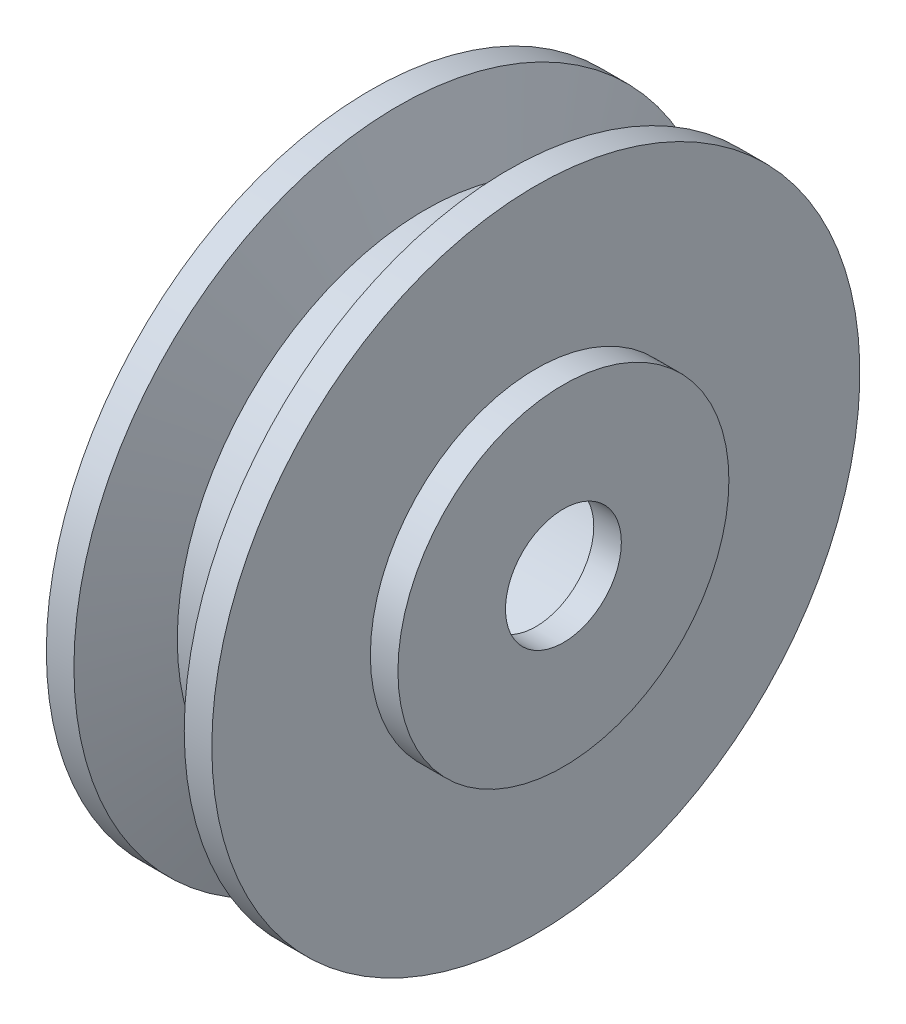
ISO-10303-21;
HEADER;
FILE_DESCRIPTION(('STEP AP214'),'2;1');
FILE_NAME('part.step','',(''),(''),'','','');
FILE_SCHEMA(('AUTOMOTIVE_DESIGN { 1 0 10303 214 1 1 1 1 }'));
ENDSEC;
DATA;
#1=APPLICATION_CONTEXT('core data for automotive mechanical design processes');
#2=APPLICATION_PROTOCOL_DEFINITION('international standard','automotive_design',2000,#1);
#3=PRODUCT_CONTEXT('',#1,'mechanical');
#4=PRODUCT('Part','Part','',(#3));
#5=PRODUCT_RELATED_PRODUCT_CATEGORY('part','',(#4));
#6=PRODUCT_DEFINITION_FORMATION('','',#4);
#7=PRODUCT_DEFINITION_CONTEXT('part definition',#1,'design');
#8=PRODUCT_DEFINITION('design','',#6,#7);
#9=PRODUCT_DEFINITION_SHAPE('','',#8);
#10=(LENGTH_UNIT() NAMED_UNIT(*) SI_UNIT(.MILLI.,.METRE.));
#11=(NAMED_UNIT(*) PLANE_ANGLE_UNIT() SI_UNIT($,.RADIAN.));
#12=(NAMED_UNIT(*) SI_UNIT($,.STERADIAN.) SOLID_ANGLE_UNIT());
#13=UNCERTAINTY_MEASURE_WITH_UNIT(LENGTH_MEASURE(1.E-05),#10,'distance_accuracy_value','');
#14=(GEOMETRIC_REPRESENTATION_CONTEXT(3) GLOBAL_UNCERTAINTY_ASSIGNED_CONTEXT((#13)) GLOBAL_UNIT_ASSIGNED_CONTEXT((#10,
#11,#12)) REPRESENTATION_CONTEXT('',''));
#15=CARTESIAN_POINT('',(0.,0.,0.));
#16=DIRECTION('',(0.,0.,1.));
#17=DIRECTION('',(1.,0.,0.));
#18=AXIS2_PLACEMENT_3D('',#15,#16,#17);
#19=CARTESIAN_POINT('',(-4.,0.,0.));
#20=DIRECTION('',(-1.,0.,0.));
#21=DIRECTION('',(0.,0.,1.));
#22=AXIS2_PLACEMENT_3D('',#19,#20,#21);
#23=PLANE('',#22);
#24=CARTESIAN_POINT('',(-4.,0.,0.));
#25=DIRECTION('',(-1.,0.,0.));
#26=DIRECTION('',(0.,0.,1.));
#27=AXIS2_PLACEMENT_3D('',#24,#25,#26);
#28=CIRCLE('',#27,6.);
#29=CARTESIAN_POINT('',(-4.,0.,6.));
#30=VERTEX_POINT('',#29);
#31=EDGE_CURVE('E11',#30,#30,#28,.T.);
#32=ORIENTED_EDGE('',*,*,#31,.T.);
#33=EDGE_LOOP('',(#32));
#34=FACE_BOUND('',#33,.T.);
#35=CARTESIAN_POINT('',(-4.,0.,0.));
#36=DIRECTION('',(-1.,0.,0.));
#37=DIRECTION('',(0.,0.,1.));
#38=AXIS2_PLACEMENT_3D('',#35,#36,#37);
#39=CIRCLE('',#38,2.1);
#40=CARTESIAN_POINT('',(-4.,0.,2.1));
#41=VERTEX_POINT('',#40);
#42=EDGE_CURVE('E50',#41,#41,#39,.T.);
#43=ORIENTED_EDGE('',*,*,#42,.F.);
#44=EDGE_LOOP('',(#43));
#45=FACE_BOUND('',#44,.T.);
#46=ADVANCED_FACE('F39',(#34,#45),#23,.T.);
#47=CARTESIAN_POINT('',(-3.,0.,0.));
#48=DIRECTION('',(-1.,0.,0.));
#49=DIRECTION('',(0.,0.,1.));
#50=AXIS2_PLACEMENT_3D('',#47,#48,#49);
#51=PLANE('',#50);
#52=CARTESIAN_POINT('',(-3.,0.,0.));
#53=DIRECTION('',(-1.,0.,0.));
#54=DIRECTION('',(0.,0.,1.));
#55=AXIS2_PLACEMENT_3D('',#52,#53,#54);
#56=CIRCLE('',#55,6.);
#57=CARTESIAN_POINT('',(-3.,0.,6.));
#58=VERTEX_POINT('',#57);
#59=EDGE_CURVE('E43',#58,#58,#56,.T.);
#60=ORIENTED_EDGE('',*,*,#59,.F.);
#61=EDGE_LOOP('',(#60));
#62=FACE_BOUND('',#61,.T.);
#63=CARTESIAN_POINT('',(-3.,0.,0.));
#64=DIRECTION('',(-1.,0.,0.));
#65=DIRECTION('',(0.,0.,1.));
#66=AXIS2_PLACEMENT_3D('',#63,#64,#65);
#67=CIRCLE('',#66,2.1);
#68=CARTESIAN_POINT('',(-3.,0.,2.1));
#69=VERTEX_POINT('',#68);
#70=EDGE_CURVE('E52',#69,#69,#67,.T.);
#71=ORIENTED_EDGE('',*,*,#70,.T.);
#72=EDGE_LOOP('',(#71));
#73=FACE_BOUND('',#72,.T.);
#74=ADVANCED_FACE('F62',(#62,#73),#51,.F.);
#75=CARTESIAN_POINT('',(-4.,0.,0.));
#76=DIRECTION('',(1.,0.,0.));
#77=DIRECTION('',(0.,0.,-1.));
#78=AXIS2_PLACEMENT_3D('',#75,#76,#77);
#79=CYLINDRICAL_SURFACE('',#78,6.);
#80=ORIENTED_EDGE('',*,*,#31,.F.);
#81=EDGE_LOOP('',(#80));
#82=FACE_BOUND('',#81,.T.);
#83=ORIENTED_EDGE('',*,*,#59,.T.);
#84=EDGE_LOOP('',(#83));
#85=FACE_BOUND('',#84,.T.);
#86=ADVANCED_FACE('F41',(#82,#85),#79,.T.);
#87=CARTESIAN_POINT('',(-4.,0.,0.));
#88=DIRECTION('',(1.,0.,0.));
#89=DIRECTION('',(0.,0.,-1.));
#90=AXIS2_PLACEMENT_3D('',#87,#88,#89);
#91=CYLINDRICAL_SURFACE('',#90,2.1);
#92=ORIENTED_EDGE('',*,*,#42,.T.);
#93=EDGE_LOOP('',(#92));
#94=FACE_BOUND('',#93,.T.);
#95=ORIENTED_EDGE('',*,*,#70,.F.);
#96=EDGE_LOOP('',(#95));
#97=FACE_BOUND('',#96,.T.);
#98=ADVANCED_FACE('F58',(#94,#97),#91,.F.);
#99=CLOSED_SHELL('',(#46,#74,#86,#98));
#100=MANIFOLD_SOLID_BREP('B2',#99);
#101=CARTESIAN_POINT('',(0.,0.,0.));
#102=DIRECTION('',(-1.,0.,0.));
#103=DIRECTION('',(0.,0.,1.));
#104=AXIS2_PLACEMENT_3D('',#101,#102,#103);
#105=CYLINDRICAL_SURFACE('',#104,9.);
#106=CARTESIAN_POINT('',(1.,0.,0.));
#107=DIRECTION('',(-1.,0.,0.));
#108=DIRECTION('',(0.,0.,1.));
#109=AXIS2_PLACEMENT_3D('',#106,#107,#108);
#110=CIRCLE('',#109,9.);
#111=CARTESIAN_POINT('',(1.,0.,9.));
#112=VERTEX_POINT('',#111);
#113=EDGE_CURVE('E107',#112,#112,#110,.T.);
#114=ORIENTED_EDGE('',*,*,#113,.T.);
#115=EDGE_LOOP('',(#114));
#116=FACE_BOUND('',#115,.T.);
#117=CARTESIAN_POINT('',(-1.,0.,0.));
#118=DIRECTION('',(-1.,0.,0.));
#119=DIRECTION('',(0.,0.,1.));
#120=AXIS2_PLACEMENT_3D('',#117,#118,#119);
#121=CIRCLE('',#120,9.);
#122=CARTESIAN_POINT('',(-1.,0.,9.));
#123=VERTEX_POINT('',#122);
#124=EDGE_CURVE('E140',#123,#123,#121,.T.);
#125=ORIENTED_EDGE('',*,*,#124,.F.);
#126=EDGE_LOOP('',(#125));
#127=FACE_BOUND('',#126,.T.);
#128=ADVANCED_FACE('F101',(#116,#127),#105,.T.);
#129=CARTESIAN_POINT('',(2.,0.,0.));
#130=DIRECTION('',(1.,0.,0.));
#131=DIRECTION('',(0.,0.,-1.));
#132=AXIS2_PLACEMENT_3D('',#129,#130,#131);
#133=CONICAL_SURFACE('',#132,11.7474774194546,1.22173047639603);
#134=ORIENTED_EDGE('',*,*,#113,.F.);
#135=EDGE_LOOP('',(#134));
#136=FACE_BOUND('',#135,.T.);
#137=CARTESIAN_POINT('',(2.,0.,0.));
#138=DIRECTION('',(-1.,0.,0.));
#139=DIRECTION('',(0.,0.,1.));
#140=AXIS2_PLACEMENT_3D('',#137,#138,#139);
#141=CIRCLE('',#140,11.7474774194546);
#142=CARTESIAN_POINT('',(2.,0.,11.7474774194546));
#143=VERTEX_POINT('',#142);
#144=EDGE_CURVE('E111',#143,#143,#141,.T.);
#145=ORIENTED_EDGE('',*,*,#144,.T.);
#146=EDGE_LOOP('',(#145));
#147=FACE_BOUND('',#146,.T.);
#148=ADVANCED_FACE('F159',(#136,#147),#133,.T.);
#149=CARTESIAN_POINT('',(0.,0.,0.));
#150=DIRECTION('',(-1.,0.,0.));
#151=DIRECTION('',(0.,0.,1.));
#152=AXIS2_PLACEMENT_3D('',#149,#150,#151);
#153=CYLINDRICAL_SURFACE('',#152,11.7474774194546);
#154=ORIENTED_EDGE('',*,*,#144,.F.);
#155=EDGE_LOOP('',(#154));
#156=FACE_BOUND('',#155,.T.);
#157=CARTESIAN_POINT('',(3.,0.,0.));
#158=DIRECTION('',(-1.,0.,0.));
#159=DIRECTION('',(0.,0.,1.));
#160=AXIS2_PLACEMENT_3D('',#157,#158,#159);
#161=CIRCLE('',#160,11.7474774194546);
#162=CARTESIAN_POINT('',(3.,0.,11.7474774194546));
#163=VERTEX_POINT('',#162);
#164=EDGE_CURVE('E116',#163,#163,#161,.T.);
#165=ORIENTED_EDGE('',*,*,#164,.T.);
#166=EDGE_LOOP('',(#165));
#167=FACE_BOUND('',#166,.T.);
#168=ADVANCED_FACE('F145',(#156,#167),#153,.T.);
#169=CARTESIAN_POINT('',(3.,11.7474774194546,0.));
#170=DIRECTION('',(-1.,0.,0.));
#171=DIRECTION('',(0.,0.,1.));
#172=AXIS2_PLACEMENT_3D('',#169,#170,#171);
#173=PLANE('',#172);
#174=CARTESIAN_POINT('',(3.,0.,0.));
#175=DIRECTION('',(-1.,0.,0.));
#176=DIRECTION('',(0.,0.,1.));
#177=AXIS2_PLACEMENT_3D('',#174,#175,#176);
#178=CIRCLE('',#177,6.);
#179=CARTESIAN_POINT('',(3.,0.,6.));
#180=VERTEX_POINT('',#179);
#181=EDGE_CURVE('E38',#180,#180,#178,.F.);
#182=ORIENTED_EDGE('',*,*,#181,.F.);
#183=EDGE_LOOP('',(#182));
#184=FACE_BOUND('',#183,.T.);
#185=ORIENTED_EDGE('',*,*,#164,.F.);
#186=EDGE_LOOP('',(#185));
#187=FACE_BOUND('',#186,.T.);
#188=ADVANCED_FACE('F147',(#184,#187),#173,.F.);
#189=CARTESIAN_POINT('',(-2.,0.,0.));
#190=DIRECTION('',(-1.,0.,0.));
#191=DIRECTION('',(0.,0.,-1.));
#192=AXIS2_PLACEMENT_3D('',#189,#190,#191);
#193=CONICAL_SURFACE('',#192,11.7474774194546,1.22173047639603);
#194=ORIENTED_EDGE('',*,*,#124,.T.);
#195=EDGE_LOOP('',(#194));
#196=FACE_BOUND('',#195,.T.);
#197=CARTESIAN_POINT('',(-2.,0.,0.));
#198=DIRECTION('',(-1.,0.,0.));
#199=DIRECTION('',(0.,0.,1.));
#200=AXIS2_PLACEMENT_3D('',#197,#198,#199);
#201=CIRCLE('',#200,11.7474774194546);
#202=CARTESIAN_POINT('',(-2.,0.,11.7474774194546));
#203=VERTEX_POINT('',#202);
#204=EDGE_CURVE('E126',#203,#203,#201,.T.);
#205=ORIENTED_EDGE('',*,*,#204,.F.);
#206=EDGE_LOOP('',(#205));
#207=FACE_BOUND('',#206,.T.);
#208=ADVANCED_FACE('F149',(#196,#207),#193,.T.);
#209=CARTESIAN_POINT('',(0.,0.,0.));
#210=DIRECTION('',(1.,0.,0.));
#211=DIRECTION('',(0.,0.,1.));
#212=AXIS2_PLACEMENT_3D('',#209,#210,#211);
#213=CYLINDRICAL_SURFACE('',#212,11.7474774194546);
#214=ORIENTED_EDGE('',*,*,#204,.T.);
#215=EDGE_LOOP('',(#214));
#216=FACE_BOUND('',#215,.T.);
#217=CARTESIAN_POINT('',(-3.,0.,0.));
#218=DIRECTION('',(-1.,0.,0.));
#219=DIRECTION('',(0.,0.,1.));
#220=AXIS2_PLACEMENT_3D('',#217,#218,#219);
#221=CIRCLE('',#220,11.7474774194546);
#222=CARTESIAN_POINT('',(-3.,0.,11.7474774194546));
#223=VERTEX_POINT('',#222);
#224=EDGE_CURVE('E121',#223,#223,#221,.T.);
#225=ORIENTED_EDGE('',*,*,#224,.F.);
#226=EDGE_LOOP('',(#225));
#227=FACE_BOUND('',#226,.T.);
#228=ADVANCED_FACE('F156',(#216,#227),#213,.T.);
#229=CARTESIAN_POINT('',(-3.,11.7474774194546,0.));
#230=DIRECTION('',(1.,0.,0.));
#231=DIRECTION('',(0.,0.,1.));
#232=AXIS2_PLACEMENT_3D('',#229,#230,#231);
#233=PLANE('',#232);
#234=CARTESIAN_POINT('',(-3.,0.,0.));
#235=DIRECTION('',(1.,0.,0.));
#236=DIRECTION('',(0.,0.,-1.));
#237=AXIS2_PLACEMENT_3D('',#234,#235,#236);
#238=CIRCLE('',#237,5.);
#239=CARTESIAN_POINT('',(-3.,0.,-5.));
#240=VERTEX_POINT('',#239);
#241=EDGE_CURVE('E119',#240,#240,#238,.T.);
#242=ORIENTED_EDGE('',*,*,#241,.T.);
#243=EDGE_LOOP('',(#242));
#244=FACE_BOUND('',#243,.T.);
#245=ORIENTED_EDGE('',*,*,#224,.T.);
#246=EDGE_LOOP('',(#245));
#247=FACE_BOUND('',#246,.T.);
#248=ADVANCED_FACE('F174',(#244,#247),#233,.F.);
#249=CARTESIAN_POINT('',(-84.,0.,0.));
#250=DIRECTION('',(1.,0.,0.));
#251=DIRECTION('',(0.,0.,-1.));
#252=AXIS2_PLACEMENT_3D('',#249,#250,#251);
#253=CYLINDRICAL_SURFACE('',#252,5.);
#254=CARTESIAN_POINT('',(3.,0.,0.));
#255=DIRECTION('',(1.,0.,0.));
#256=DIRECTION('',(0.,0.,-1.));
#257=AXIS2_PLACEMENT_3D('',#254,#255,#256);
#258=CIRCLE('',#257,5.);
#259=CARTESIAN_POINT('',(3.,0.,-5.));
#260=VERTEX_POINT('',#259);
#261=EDGE_CURVE('E122',#260,#260,#258,.F.);
#262=ORIENTED_EDGE('',*,*,#261,.F.);
#263=EDGE_LOOP('',(#262));
#264=FACE_BOUND('',#263,.T.);
#265=ORIENTED_EDGE('',*,*,#241,.F.);
#266=EDGE_LOOP('',(#265));
#267=FACE_BOUND('',#266,.T.);
#268=ADVANCED_FACE('F179',(#264,#267),#253,.F.);
#269=CARTESIAN_POINT('',(3.,0.,0.));
#270=DIRECTION('',(1.,0.,0.));
#271=DIRECTION('',(0.,0.,-1.));
#272=AXIS2_PLACEMENT_3D('',#269,#270,#271);
#273=PLANE('',#272);
#274=CARTESIAN_POINT('',(3.,0.,0.));
#275=DIRECTION('',(1.,0.,0.));
#276=DIRECTION('',(0.,0.,-1.));
#277=AXIS2_PLACEMENT_3D('',#274,#275,#276);
#278=CIRCLE('',#277,2.1);
#279=CARTESIAN_POINT('',(3.,0.,-2.1));
#280=VERTEX_POINT('',#279);
#281=EDGE_CURVE('E209',#280,#280,#278,.T.);
#282=ORIENTED_EDGE('',*,*,#281,.T.);
#283=EDGE_LOOP('',(#282));
#284=FACE_BOUND('',#283,.T.);
#285=ORIENTED_EDGE('',*,*,#261,.T.);
#286=EDGE_LOOP('',(#285));
#287=FACE_BOUND('',#286,.T.);
#288=ADVANCED_FACE('F184',(#284,#287),#273,.F.);
#289=CARTESIAN_POINT('',(4.,0.,0.));
#290=DIRECTION('',(1.,0.,0.));
#291=DIRECTION('',(0.,0.,-1.));
#292=AXIS2_PLACEMENT_3D('',#289,#290,#291);
#293=PLANE('',#292);
#294=CARTESIAN_POINT('',(4.,0.,0.));
#295=DIRECTION('',(1.,0.,0.));
#296=DIRECTION('',(0.,0.,-1.));
#297=AXIS2_PLACEMENT_3D('',#294,#295,#296);
#298=CIRCLE('',#297,6.);
#299=CARTESIAN_POINT('',(4.,0.,-6.));
#300=VERTEX_POINT('',#299);
#301=EDGE_CURVE('E129',#300,#300,#298,.T.);
#302=ORIENTED_EDGE('',*,*,#301,.T.);
#303=EDGE_LOOP('',(#302));
#304=FACE_BOUND('',#303,.T.);
#305=CARTESIAN_POINT('',(4.,0.,0.));
#306=DIRECTION('',(1.,0.,0.));
#307=DIRECTION('',(0.,0.,-1.));
#308=AXIS2_PLACEMENT_3D('',#305,#306,#307);
#309=CIRCLE('',#308,2.1);
#310=CARTESIAN_POINT('',(4.,0.,-2.1));
#311=VERTEX_POINT('',#310);
#312=EDGE_CURVE('E134',#311,#311,#309,.T.);
#313=ORIENTED_EDGE('',*,*,#312,.F.);
#314=EDGE_LOOP('',(#313));
#315=FACE_BOUND('',#314,.T.);
#316=ADVANCED_FACE('F192',(#304,#315),#293,.T.);
#317=CARTESIAN_POINT('',(4.,0.,0.));
#318=DIRECTION('',(-1.,0.,0.));
#319=DIRECTION('',(0.,0.,1.));
#320=AXIS2_PLACEMENT_3D('',#317,#318,#319);
#321=CYLINDRICAL_SURFACE('',#320,6.);
#322=ORIENTED_EDGE('',*,*,#301,.F.);
#323=EDGE_LOOP('',(#322));
#324=FACE_BOUND('',#323,.T.);
#325=ORIENTED_EDGE('',*,*,#181,.T.);
#326=EDGE_LOOP('',(#325));
#327=FACE_BOUND('',#326,.T.);
#328=ADVANCED_FACE('F188',(#324,#327),#321,.T.);
#329=CARTESIAN_POINT('',(4.,0.,0.));
#330=DIRECTION('',(-1.,0.,0.));
#331=DIRECTION('',(0.,0.,1.));
#332=AXIS2_PLACEMENT_3D('',#329,#330,#331);
#333=CYLINDRICAL_SURFACE('',#332,2.1);
#334=ORIENTED_EDGE('',*,*,#312,.T.);
#335=EDGE_LOOP('',(#334));
#336=FACE_BOUND('',#335,.T.);
#337=ORIENTED_EDGE('',*,*,#281,.F.);
#338=EDGE_LOOP('',(#337));
#339=FACE_BOUND('',#338,.T.);
#340=ADVANCED_FACE('F191',(#336,#339),#333,.F.);
#341=CLOSED_SHELL('',(#128,#148,#168,#188,#208,#228,#248,#268,#288,#316,#328,#340));
#342=MANIFOLD_SOLID_BREP('B6',#341);
#343=ADVANCED_BREP_SHAPE_REPRESENTATION('',(#18,#100,#342),#14);
#344=SHAPE_DEFINITION_REPRESENTATION(#9,#343);
ENDSEC;
END-ISO-10303-21;
